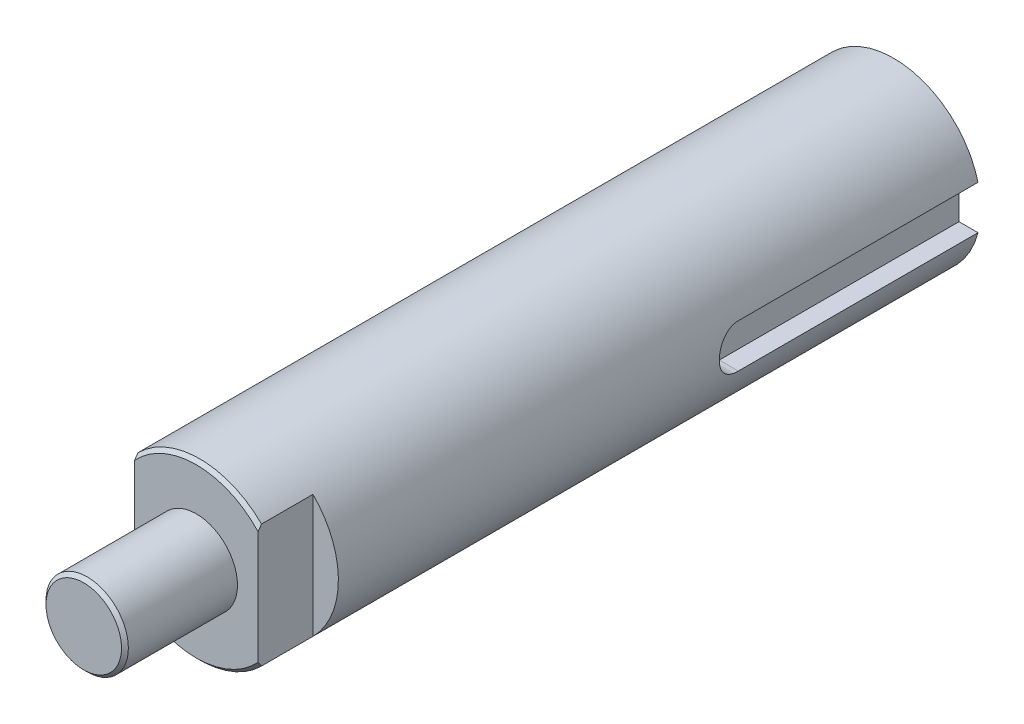
ISO-10303-21;
HEADER;
FILE_DESCRIPTION(('STEP AP214'),'2;1');
FILE_NAME('part.step','',(''),(''),'','','');
FILE_SCHEMA(('AUTOMOTIVE_DESIGN { 1 0 10303 214 1 1 1 1 }'));
ENDSEC;
DATA;
#1=APPLICATION_CONTEXT('core data for automotive mechanical design processes');
#2=APPLICATION_PROTOCOL_DEFINITION('international standard','automotive_design',2000,#1);
#3=PRODUCT_CONTEXT('',#1,'mechanical');
#4=PRODUCT('Part','Part','',(#3));
#5=PRODUCT_RELATED_PRODUCT_CATEGORY('part','',(#4));
#6=PRODUCT_DEFINITION_FORMATION('','',#4);
#7=PRODUCT_DEFINITION_CONTEXT('part definition',#1,'design');
#8=PRODUCT_DEFINITION('design','',#6,#7);
#9=PRODUCT_DEFINITION_SHAPE('','',#8);
#10=(LENGTH_UNIT() NAMED_UNIT(*) SI_UNIT(.MILLI.,.METRE.));
#11=(NAMED_UNIT(*) PLANE_ANGLE_UNIT() SI_UNIT($,.RADIAN.));
#12=(NAMED_UNIT(*) SI_UNIT($,.STERADIAN.) SOLID_ANGLE_UNIT());
#13=UNCERTAINTY_MEASURE_WITH_UNIT(LENGTH_MEASURE(1.E-05),#10,'distance_accuracy_value','');
#14=(GEOMETRIC_REPRESENTATION_CONTEXT(3) GLOBAL_UNCERTAINTY_ASSIGNED_CONTEXT((#13)) GLOBAL_UNIT_ASSIGNED_CONTEXT((#10,
#11,#12)) REPRESENTATION_CONTEXT('',''));
#15=CARTESIAN_POINT('',(0.,0.,0.));
#16=DIRECTION('',(0.,0.,1.));
#17=DIRECTION('',(1.,0.,0.));
#18=AXIS2_PLACEMENT_3D('',#15,#16,#17);
#19=CARTESIAN_POINT('',(4.69320694689479,1.5875,34.845625));
#20=DIRECTION('',(0.,-1.,0.));
#21=DIRECTION('',(0.,0.,-1.));
#22=AXIS2_PLACEMENT_3D('',#19,#20,#21);
#23=PLANE('',#22);
#24=DIRECTION('',(0.,0.,-1.));
#25=VECTOR('',#24,1.);
#26=CARTESIAN_POINT('',(4.7625,1.5875,36.5125));
#27=LINE('',#26,#25);
#28=CARTESIAN_POINT('',(4.7625,1.5875,12.7));
#29=VERTEX_POINT('',#28);
#30=CARTESIAN_POINT('',(4.7625,1.5875,30.1625));
#31=VERTEX_POINT('',#30);
#32=EDGE_CURVE('E35',#29,#31,#27,.F.);
#33=ORIENTED_EDGE('',*,*,#32,.F.);
#34=DIRECTION('',(1.,0.,0.));
#35=VECTOR('',#34,1.);
#36=CARTESIAN_POINT('',(4.69320694689479,1.5875,12.7));
#37=LINE('',#36,#35);
#38=CARTESIAN_POINT('',(6.14836106210428,1.58749999999999,12.7));
#39=VERTEX_POINT('',#38);
#40=EDGE_CURVE('E102',#29,#39,#37,.T.);
#41=ORIENTED_EDGE('',*,*,#40,.T.);
#42=DIRECTION('',(0.,0.,-1.));
#43=VECTOR('',#42,1.);
#44=CARTESIAN_POINT('',(6.14836106210428,1.58749999999999,0.));
#45=LINE('',#44,#43);
#46=CARTESIAN_POINT('',(6.14836106210428,1.58749999999999,30.1625));
#47=VERTEX_POINT('',#46);
#48=EDGE_CURVE('E152',#47,#39,#45,.T.);
#49=ORIENTED_EDGE('',*,*,#48,.F.);
#50=DIRECTION('',(1.,0.,0.));
#51=VECTOR('',#50,1.);
#52=CARTESIAN_POINT('',(5.55625,1.5875,30.1625));
#53=LINE('',#52,#51);
#54=EDGE_CURVE('E233',#31,#47,#53,.T.);
#55=ORIENTED_EDGE('',*,*,#54,.F.);
#56=EDGE_LOOP('',(#33,#41,#49,#55));
#57=FACE_BOUND('',#56,.T.);
#58=ADVANCED_FACE('F31',(#57),#23,.T.);
#59=CARTESIAN_POINT('',(4.7625,-1.74625,36.5125));
#60=DIRECTION('',(1.,0.,0.));
#61=DIRECTION('',(0.,0.,-1.));
#62=AXIS2_PLACEMENT_3D('',#59,#60,#61);
#63=PLANE('',#62);
#64=DIRECTION('',(0.,0.,1.));
#65=VECTOR('',#64,1.);
#66=CARTESIAN_POINT('',(4.7625,-1.5875,-68.183125));
#67=LINE('',#66,#65);
#68=CARTESIAN_POINT('',(4.7625,-1.5875,12.7));
#69=VERTEX_POINT('',#68);
#70=CARTESIAN_POINT('',(4.7625,-1.5875,30.1625));
#71=VERTEX_POINT('',#70);
#72=EDGE_CURVE('E209',#69,#71,#67,.T.);
#73=ORIENTED_EDGE('',*,*,#72,.F.);
#74=DIRECTION('',(0.,1.,0.));
#75=VECTOR('',#74,1.);
#76=CARTESIAN_POINT('',(4.7625,-1.74625,12.7));
#77=LINE('',#76,#75);
#78=EDGE_CURVE('E48',#69,#29,#77,.T.);
#79=ORIENTED_EDGE('',*,*,#78,.T.);
#80=ORIENTED_EDGE('',*,*,#32,.T.);
#81=CARTESIAN_POINT('',(4.7625,0.,30.1625));
#82=DIRECTION('',(-1.,0.,0.));
#83=DIRECTION('',(0.,-1.,0.));
#84=AXIS2_PLACEMENT_3D('',#81,#82,#83);
#85=CIRCLE('',#84,1.5875);
#86=EDGE_CURVE('E153',#31,#71,#85,.F.);
#87=ORIENTED_EDGE('',*,*,#86,.T.);
#88=EDGE_LOOP('',(#73,#79,#80,#87));
#89=FACE_BOUND('',#88,.T.);
#90=ADVANCED_FACE('F198',(#89),#63,.T.);
#91=CARTESIAN_POINT('',(0.,0.,63.25));
#92=DIRECTION('',(0.,0.,1.));
#93=DIRECTION('',(1.,0.,0.));
#94=AXIS2_PLACEMENT_3D('',#91,#92,#93);
#95=CYLINDRICAL_SURFACE('',#94,6.35);
#96=CARTESIAN_POINT('',(0.,0.,59.5));
#97=DIRECTION('',(0.,0.,1.));
#98=DIRECTION('',(1.,0.,0.));
#99=AXIS2_PLACEMENT_3D('',#96,#97,#98);
#100=CIRCLE('',#99,6.35);
#101=CARTESIAN_POINT('',(4.5,4.48023436886956,59.5));
#102=VERTEX_POINT('',#101);
#103=CARTESIAN_POINT('',(4.5,-4.48023436886955,59.5));
#104=VERTEX_POINT('',#103);
#105=EDGE_CURVE('E145',#102,#104,#100,.F.);
#106=ORIENTED_EDGE('',*,*,#105,.T.);
#107=DIRECTION('',(0.,0.,1.));
#108=VECTOR('',#107,1.);
#109=CARTESIAN_POINT('',(4.5,-4.48023436886955,0.));
#110=LINE('',#109,#108);
#111=CARTESIAN_POINT('',(4.5,-4.48023436886956,63.25));
#112=VERTEX_POINT('',#111);
#113=EDGE_CURVE('E213',#104,#112,#110,.T.);
#114=ORIENTED_EDGE('',*,*,#113,.T.);
#115=CARTESIAN_POINT('',(0.,0.,63.25));
#116=DIRECTION('',(0.,0.,1.));
#117=DIRECTION('',(-1.,0.,0.));
#118=AXIS2_PLACEMENT_3D('',#115,#116,#117);
#119=CIRCLE('',#118,6.35);
#120=CARTESIAN_POINT('',(-4.5,-4.48023436886956,63.25));
#121=VERTEX_POINT('',#120);
#122=EDGE_CURVE('E141',#112,#121,#119,.F.);
#123=ORIENTED_EDGE('',*,*,#122,.T.);
#124=DIRECTION('',(0.,0.,-1.));
#125=VECTOR('',#124,1.);
#126=CARTESIAN_POINT('',(-4.5,-4.48023436886956,0.));
#127=LINE('',#126,#125);
#128=CARTESIAN_POINT('',(-4.5,-4.48023436886956,59.5));
#129=VERTEX_POINT('',#128);
#130=EDGE_CURVE('E139',#121,#129,#127,.T.);
#131=ORIENTED_EDGE('',*,*,#130,.T.);
#132=CARTESIAN_POINT('',(0.,0.,59.5));
#133=DIRECTION('',(0.,0.,1.));
#134=DIRECTION('',(1.,0.,0.));
#135=AXIS2_PLACEMENT_3D('',#132,#133,#134);
#136=CIRCLE('',#135,6.35);
#137=CARTESIAN_POINT('',(-4.5,4.48023436886956,59.5));
#138=VERTEX_POINT('',#137);
#139=EDGE_CURVE('E119',#129,#138,#136,.F.);
#140=ORIENTED_EDGE('',*,*,#139,.T.);
#141=DIRECTION('',(0.,0.,1.));
#142=VECTOR('',#141,1.);
#143=CARTESIAN_POINT('',(-4.5,4.48023436886956,0.));
#144=LINE('',#143,#142);
#145=CARTESIAN_POINT('',(-4.5,4.48023436886956,63.25));
#146=VERTEX_POINT('',#145);
#147=EDGE_CURVE('E127',#138,#146,#144,.T.);
#148=ORIENTED_EDGE('',*,*,#147,.T.);
#149=CARTESIAN_POINT('',(0.,0.,63.25));
#150=DIRECTION('',(0.,0.,1.));
#151=DIRECTION('',(-1.,0.,0.));
#152=AXIS2_PLACEMENT_3D('',#149,#150,#151);
#153=CIRCLE('',#152,6.35);
#154=CARTESIAN_POINT('',(4.5,4.48023436886956,63.25));
#155=VERTEX_POINT('',#154);
#156=EDGE_CURVE('E133',#146,#155,#153,.F.);
#157=ORIENTED_EDGE('',*,*,#156,.T.);
#158=DIRECTION('',(0.,0.,-1.));
#159=VECTOR('',#158,1.);
#160=CARTESIAN_POINT('',(4.5,4.48023436886956,0.));
#161=LINE('',#160,#159);
#162=EDGE_CURVE('E229',#155,#102,#161,.T.);
#163=ORIENTED_EDGE('',*,*,#162,.T.);
#164=EDGE_LOOP('',(#106,#114,#123,#131,#140,#148,#157,#163));
#165=FACE_BOUND('',#164,.T.);
#166=ORIENTED_EDGE('',*,*,#48,.T.);
#167=CARTESIAN_POINT('',(0.,0.,12.7));
#168=DIRECTION('',(0.,0.,-1.));
#169=DIRECTION('',(-1.,0.,0.));
#170=AXIS2_PLACEMENT_3D('',#167,#168,#169);
#171=CIRCLE('',#170,6.35);
#172=CARTESIAN_POINT('',(6.14836106210428,-1.5875,12.7));
#173=VERTEX_POINT('',#172);
#174=EDGE_CURVE('E390',#39,#173,#171,.F.);
#175=ORIENTED_EDGE('',*,*,#174,.T.);
#176=DIRECTION('',(0.,0.,1.));
#177=VECTOR('',#176,1.);
#178=CARTESIAN_POINT('',(6.14836106210428,-1.5875,-68.183125));
#179=LINE('',#178,#177);
#180=CARTESIAN_POINT('',(6.14836106210428,-1.5875,30.1625));
#181=VERTEX_POINT('',#180);
#182=EDGE_CURVE('E41',#181,#173,#179,.F.);
#183=ORIENTED_EDGE('',*,*,#182,.F.);
#184=CARTESIAN_POINT('',(6.14836106210427,-1.5875,30.1625));
#185=CARTESIAN_POINT('',(6.14835810868573,-1.58750053472211,30.2064149519943));
#186=CARTESIAN_POINT('',(6.1488321571389,-1.58567661174546,30.2503081438792));
#187=CARTESIAN_POINT('',(6.15070373440419,-1.57840569717736,30.3377662599224));
#188=CARTESIAN_POINT('',(6.15210110782842,-1.57295931521449,30.3813312380687));
#189=CARTESIAN_POINT('',(6.1576221525004,-1.55126572658893,30.5108817698074));
#190=CARTESIAN_POINT('',(6.16307509376748,-1.52966372960041,30.595977074072));
#191=CARTESIAN_POINT('',(6.17688995608206,-1.47287895457943,30.7611868798194));
#192=CARTESIAN_POINT('',(6.18525165274125,-1.43769722409702,30.8413017649419));
#193=CARTESIAN_POINT('',(6.20393662510198,-1.35479517756304,30.9945295247074));
#194=CARTESIAN_POINT('',(6.21426035741522,-1.30707194181757,31.0676407634689));
#195=CARTESIAN_POINT('',(6.23595707887749,-1.1993371670561,31.2063439347201));
#196=CARTESIAN_POINT('',(6.24734667388769,-1.13910300733152,31.271760299379));
#197=CARTESIAN_POINT('',(6.26975132963679,-1.00851371119877,31.3916937691142));
#198=CARTESIAN_POINT('',(6.28076625476574,-0.938154957437522,31.4462069619563));
#199=CARTESIAN_POINT('',(6.30136714833112,-0.788089535804105,31.5435081462468));
#200=CARTESIAN_POINT('',(6.31093033514495,-0.708263180753407,31.5861165956048));
#201=CARTESIAN_POINT('',(6.32734283789911,-0.542357177260235,31.6572003435318));
#202=CARTESIAN_POINT('',(6.33419540463604,-0.456285166695508,31.685692581835));
#203=CARTESIAN_POINT('',(6.34280690605921,-0.308152380307642,31.7210378606793));
#204=CARTESIAN_POINT('',(6.34549035539136,-0.247067257357061,31.7318799469506));
#205=CARTESIAN_POINT('',(6.3490876888745,-0.123996454410234,31.7463623085414));
#206=CARTESIAN_POINT('',(6.35000159882553,-0.062010787557275,31.7500026888624));
#207=CARTESIAN_POINT('',(6.34999773933436,0.0876803967486356,31.7499961980724));
#208=CARTESIAN_POINT('',(6.34816513335973,0.175411016460152,31.742708932828));
#209=CARTESIAN_POINT('',(6.34102879138945,0.348380525034637,31.7137871064531));
#210=CARTESIAN_POINT('',(6.33572174751383,0.433616958406108,31.6921388725301));
#211=CARTESIAN_POINT('',(6.32222512421158,0.599040292949523,31.6352341920645));
#212=CARTESIAN_POINT('',(6.3140394800964,0.679233912557767,31.5999963174863));
#213=CARTESIAN_POINT('',(6.29565763049597,0.832565934999531,31.5169718450794));
#214=CARTESIAN_POINT('',(6.28546147615122,0.905704517218627,31.4691855664289));
#215=CARTESIAN_POINT('',(6.26393038121457,1.04436365780342,31.3613805762075));
#216=CARTESIAN_POINT('',(6.25257786624043,1.10971829889362,31.3011519679792));
#217=CARTESIAN_POINT('',(6.2301296384948,1.22951519838159,31.1706157524361));
#218=CARTESIAN_POINT('',(6.21903396685861,1.28395571935549,31.1003065434363));
#219=CARTESIAN_POINT('',(6.19817668389332,1.38116725538388,30.9503082320332));
#220=CARTESIAN_POINT('',(6.18843780250452,1.42374920363026,30.8704932823966));
#221=CARTESIAN_POINT('',(6.17166094046039,1.49480507045921,30.7045731029571));
#222=CARTESIAN_POINT('',(6.16462093284005,1.52328958149317,30.6184726519095));
#223=CARTESIAN_POINT('',(6.15576956135878,1.55859647860432,30.4703419677354));
#224=CARTESIAN_POINT('',(6.15300921691422,1.5694184144922,30.4092921880725));
#225=CARTESIAN_POINT('',(6.14929718216966,1.58387467718142,30.2863392534877));
#226=CARTESIAN_POINT('',(6.14834418929123,1.58751418051883,30.2244367455719));
#227=CARTESIAN_POINT('',(6.14836106210427,1.5875,30.1625));
#228=B_SPLINE_CURVE_WITH_KNOTS('',3,(#184,#185,#186,#187,#188,#189,#190,#191,#192,#193,#194,
#195,#196,#197,#198,#199,#200,#201,#202,#203,#204,#205,#206,#207,#208,#209,#210,#211,#212,#213,
#214,#215,#216,#217,#218,#219,#220,#221,#222,#223,#224,#225,#226,#227),.UNSPECIFIED.,.F.,.F.,(4,
2,2,2,2,2,2,2,2,2,2,2,2,2,2,2,2,2,2,2,2,4),(0.,0.131661631551339,0.263301111190632,
0.525827565802086,0.788333772987202,1.05090114649685,1.31861744482507,1.58642963242961,
1.85808613315677,2.12941584627081,2.31528840630699,2.50115825628429,2.76396966106714,
3.02703164315823,3.28973538447958,3.5524324443777,3.81998818241836,4.08758647901982,
4.35923443864542,4.63067797793237,4.81644389573702,5.00207587901888),.UNSPECIFIED.);
#229=EDGE_CURVE('E56',#181,#47,#228,.T.);
#230=ORIENTED_EDGE('',*,*,#229,.T.);
#231=EDGE_LOOP('',(#166,#175,#183,#230));
#232=FACE_BOUND('',#231,.T.);
#233=ADVANCED_FACE('F136',(#165,#232),#95,.T.);
#234=CARTESIAN_POINT('',(4.69320694689479,-1.5875,-68.183125));
#235=DIRECTION('',(0.,1.,0.));
#236=DIRECTION('',(0.,0.,1.));
#237=AXIS2_PLACEMENT_3D('',#234,#235,#236);
#238=PLANE('',#237);
#239=ORIENTED_EDGE('',*,*,#182,.T.);
#240=DIRECTION('',(-1.,0.,0.));
#241=VECTOR('',#240,1.);
#242=CARTESIAN_POINT('',(4.69320694689478,-1.5875,12.7));
#243=LINE('',#242,#241);
#244=EDGE_CURVE('E12',#173,#69,#243,.T.);
#245=ORIENTED_EDGE('',*,*,#244,.T.);
#246=ORIENTED_EDGE('',*,*,#72,.T.);
#247=DIRECTION('',(-1.,0.,0.));
#248=VECTOR('',#247,1.);
#249=CARTESIAN_POINT('',(5.55625,-1.5875,30.1625));
#250=LINE('',#249,#248);
#251=EDGE_CURVE('E235',#181,#71,#250,.T.);
#252=ORIENTED_EDGE('',*,*,#251,.F.);
#253=EDGE_LOOP('',(#239,#245,#246,#252));
#254=FACE_BOUND('',#253,.T.);
#255=ADVANCED_FACE('F33',(#254),#238,.T.);
#256=CARTESIAN_POINT('',(-3.025,-3.025,71.7));
#257=DIRECTION('',(0.,0.,1.));
#258=DIRECTION('',(1.,0.,0.));
#259=AXIS2_PLACEMENT_3D('',#256,#257,#258);
#260=PLANE('',#259);
#261=CARTESIAN_POINT('',(0.,0.,71.7));
#262=DIRECTION('',(0.,0.,-1.));
#263=DIRECTION('',(-1.,0.,0.));
#264=AXIS2_PLACEMENT_3D('',#261,#262,#263);
#265=CIRCLE('',#264,2.75000000000001);
#266=CARTESIAN_POINT('',(-2.75000000000001,0.,71.7));
#267=VERTEX_POINT('',#266);
#268=EDGE_CURVE('E221',#267,#267,#265,.T.);
#269=ORIENTED_EDGE('',*,*,#268,.F.);
#270=EDGE_LOOP('',(#269));
#271=FACE_BOUND('',#270,.T.);
#272=ADVANCED_FACE('F294',(#271),#260,.T.);
#273=CARTESIAN_POINT('',(0.,0.,71.45));
#274=DIRECTION('',(0.,0.,-1.));
#275=DIRECTION('',(-1.,0.,0.));
#276=AXIS2_PLACEMENT_3D('',#273,#274,#275);
#277=CONICAL_SURFACE('',#276,3.,0.785398163397439);
#278=CARTESIAN_POINT('',(0.,0.,71.45));
#279=DIRECTION('',(0.,0.,1.));
#280=DIRECTION('',(-1.,0.,0.));
#281=AXIS2_PLACEMENT_3D('',#278,#279,#280);
#282=CIRCLE('',#281,3.);
#283=CARTESIAN_POINT('',(-3.,0.,71.45));
#284=VERTEX_POINT('',#283);
#285=EDGE_CURVE('E374',#284,#284,#282,.F.);
#286=ORIENTED_EDGE('',*,*,#285,.F.);
#287=EDGE_LOOP('',(#286));
#288=FACE_BOUND('',#287,.T.);
#289=ORIENTED_EDGE('',*,*,#268,.T.);
#290=EDGE_LOOP('',(#289));
#291=FACE_BOUND('',#290,.T.);
#292=ADVANCED_FACE('F285',(#288,#291),#277,.T.);
#293=CARTESIAN_POINT('',(0.,0.,71.45));
#294=DIRECTION('',(0.,0.,1.));
#295=DIRECTION('',(1.,0.,0.));
#296=AXIS2_PLACEMENT_3D('',#293,#294,#295);
#297=CYLINDRICAL_SURFACE('',#296,3.);
#298=ORIENTED_EDGE('',*,*,#285,.T.);
#299=EDGE_LOOP('',(#298));
#300=FACE_BOUND('',#299,.T.);
#301=CARTESIAN_POINT('',(0.,0.,63.5));
#302=DIRECTION('',(0.,0.,1.));
#303=DIRECTION('',(1.,0.,0.));
#304=AXIS2_PLACEMENT_3D('',#301,#302,#303);
#305=CIRCLE('',#304,3.);
#306=CARTESIAN_POINT('',(3.,0.,63.5));
#307=VERTEX_POINT('',#306);
#308=EDGE_CURVE('E238',#307,#307,#305,.F.);
#309=ORIENTED_EDGE('',*,*,#308,.F.);
#310=EDGE_LOOP('',(#309));
#311=FACE_BOUND('',#310,.T.);
#312=ADVANCED_FACE('F276',(#300,#311),#297,.T.);
#313=CARTESIAN_POINT('',(-4.95,-6.71,63.5));
#314=DIRECTION('',(0.,0.,1.));
#315=DIRECTION('',(1.,0.,0.));
#316=AXIS2_PLACEMENT_3D('',#313,#314,#315);
#317=PLANE('',#316);
#318=ORIENTED_EDGE('',*,*,#308,.T.);
#319=EDGE_LOOP('',(#318));
#320=FACE_BOUND('',#319,.T.);
#321=CARTESIAN_POINT('',(0.,0.,63.5));
#322=DIRECTION('',(0.,0.,-1.));
#323=DIRECTION('',(-1.,0.,0.));
#324=AXIS2_PLACEMENT_3D('',#321,#322,#323);
#325=CIRCLE('',#324,6.10000000000001);
#326=CARTESIAN_POINT('',(-4.5,4.11825205639481,63.5));
#327=VERTEX_POINT('',#326);
#328=CARTESIAN_POINT('',(4.5,4.11825205639481,63.5));
#329=VERTEX_POINT('',#328);
#330=EDGE_CURVE('E185',#327,#329,#325,.T.);
#331=ORIENTED_EDGE('',*,*,#330,.F.);
#332=DIRECTION('',(0.,1.,0.));
#333=VECTOR('',#332,1.);
#334=CARTESIAN_POINT('',(-4.5,-4.92825780575651,63.5));
#335=LINE('',#334,#333);
#336=CARTESIAN_POINT('',(-4.5,-4.11825205639481,63.5));
#337=VERTEX_POINT('',#336);
#338=EDGE_CURVE('E124',#337,#327,#335,.T.);
#339=ORIENTED_EDGE('',*,*,#338,.F.);
#340=CARTESIAN_POINT('',(0.,0.,63.5));
#341=DIRECTION('',(0.,0.,-1.));
#342=DIRECTION('',(-1.,0.,0.));
#343=AXIS2_PLACEMENT_3D('',#340,#341,#342);
#344=CIRCLE('',#343,6.1);
#345=CARTESIAN_POINT('',(4.5,-4.1182520563948,63.5));
#346=VERTEX_POINT('',#345);
#347=EDGE_CURVE('E96',#346,#337,#344,.T.);
#348=ORIENTED_EDGE('',*,*,#347,.F.);
#349=DIRECTION('',(0.,1.,0.));
#350=VECTOR('',#349,1.);
#351=CARTESIAN_POINT('',(4.5,-4.92825780575651,63.5));
#352=LINE('',#351,#350);
#353=EDGE_CURVE('E384',#329,#346,#352,.F.);
#354=ORIENTED_EDGE('',*,*,#353,.F.);
#355=EDGE_LOOP('',(#331,#339,#348,#354));
#356=FACE_BOUND('',#355,.T.);
#357=ADVANCED_FACE('F163',(#320,#356),#317,.T.);
#358=CARTESIAN_POINT('',(6.359525,0.,30.1625));
#359=DIRECTION('',(-1.,0.,0.));
#360=DIRECTION('',(0.,-1.,0.));
#361=AXIS2_PLACEMENT_3D('',#358,#359,#360);
#362=CYLINDRICAL_SURFACE('',#361,1.5875);
#363=ORIENTED_EDGE('',*,*,#86,.F.);
#364=ORIENTED_EDGE('',*,*,#54,.T.);
#365=ORIENTED_EDGE('',*,*,#229,.F.);
#366=ORIENTED_EDGE('',*,*,#251,.T.);
#367=EDGE_LOOP('',(#363,#364,#365,#366));
#368=FACE_BOUND('',#367,.T.);
#369=ADVANCED_FACE('F157',(#368),#362,.F.);
#370=CARTESIAN_POINT('',(0.,0.,63.25));
#371=DIRECTION('',(0.,0.,-1.));
#372=DIRECTION('',(-1.,0.,0.));
#373=AXIS2_PLACEMENT_3D('',#370,#371,#372);
#374=CONICAL_SURFACE('',#373,6.35000000000001,0.785398163397452);
#375=CARTESIAN_POINT('',(4.5,-4.11825205639481,63.5));
#376=CARTESIAN_POINT('',(4.5,-4.17901147246281,63.458954470691));
#377=CARTESIAN_POINT('',(4.5,-4.23955638914491,63.4175983614489));
#378=CARTESIAN_POINT('',(4.5,-4.36021715951315,63.3342650274543));
#379=CARTESIAN_POINT('',(4.5,-4.42033301365597,63.2922878033631));
#380=CARTESIAN_POINT('',(4.5,-4.48023436886957,63.25));
#381=B_SPLINE_CURVE_WITH_KNOTS('',3,(#375,#376,#377,#378,#379,#380),.UNSPECIFIED.,.F.,.F.,(4,2,
4),(0.,0.219963934246499,0.439927634332499),.UNSPECIFIED.);
#382=EDGE_CURVE('E178',#346,#112,#381,.T.);
#383=ORIENTED_EDGE('',*,*,#382,.F.);
#384=ORIENTED_EDGE('',*,*,#347,.T.);
#385=CARTESIAN_POINT('',(-4.5,-4.48023436886957,63.25));
#386=CARTESIAN_POINT('',(-4.5,-4.42033301365597,63.2922878033631));
#387=CARTESIAN_POINT('',(-4.5,-4.36021715951315,63.3342650274543));
#388=CARTESIAN_POINT('',(-4.5,-4.23955638914491,63.4175983614489));
#389=CARTESIAN_POINT('',(-4.5,-4.17901147246281,63.458954470691));
#390=CARTESIAN_POINT('',(-4.5,-4.11825205639481,63.5));
#391=B_SPLINE_CURVE_WITH_KNOTS('',3,(#385,#386,#387,#388,#389,#390),.UNSPECIFIED.,.F.,.F.,(4,2,
4),(0.,0.219963700085999,0.439927634332499),.UNSPECIFIED.);
#392=EDGE_CURVE('E171',#121,#337,#391,.T.);
#393=ORIENTED_EDGE('',*,*,#392,.F.);
#394=ORIENTED_EDGE('',*,*,#122,.F.);
#395=EDGE_LOOP('',(#383,#384,#393,#394));
#396=FACE_BOUND('',#395,.T.);
#397=ADVANCED_FACE('F162',(#396),#374,.T.);
#398=CARTESIAN_POINT('',(-6.41727006554476,-4.92825780575651,59.5));
#399=DIRECTION('',(0.,0.,1.));
#400=DIRECTION('',(1.,0.,0.));
#401=AXIS2_PLACEMENT_3D('',#398,#399,#400);
#402=PLANE('',#401);
#403=DIRECTION('',(0.,1.,0.));
#404=VECTOR('',#403,1.);
#405=CARTESIAN_POINT('',(-4.5,-4.92825780575651,59.5));
#406=LINE('',#405,#404);
#407=EDGE_CURVE('E115',#138,#129,#406,.F.);
#408=ORIENTED_EDGE('',*,*,#407,.F.);
#409=ORIENTED_EDGE('',*,*,#139,.F.);
#410=EDGE_LOOP('',(#408,#409));
#411=FACE_BOUND('',#410,.T.);
#412=ADVANCED_FACE('F117',(#411),#402,.T.);
#413=CARTESIAN_POINT('',(-4.5,-4.92825780575651,59.3));
#414=DIRECTION('',(-1.,0.,0.));
#415=DIRECTION('',(0.,0.,1.));
#416=AXIS2_PLACEMENT_3D('',#413,#414,#415);
#417=PLANE('',#416);
#418=ORIENTED_EDGE('',*,*,#407,.T.);
#419=ORIENTED_EDGE('',*,*,#130,.F.);
#420=ORIENTED_EDGE('',*,*,#392,.T.);
#421=ORIENTED_EDGE('',*,*,#338,.T.);
#422=CARTESIAN_POINT('',(-4.5,4.48023436886956,63.25));
#423=CARTESIAN_POINT('',(-4.50000009558924,4.4649613914344,63.2607757568189));
#424=CARTESIAN_POINT('',(-4.50000020265471,4.44967537760635,63.2715330408831));
#425=CARTESIAN_POINT('',(-4.50000041171611,4.41916190785276,63.292950117644));
#426=CARTESIAN_POINT('',(-4.50000051373692,4.40393459896384,63.3036101198317));
#427=CARTESIAN_POINT('',(-4.50000068587664,4.37353826941478,63.3248326359594));
#428=CARTESIAN_POINT('',(-4.50000075617019,4.35836939692252,63.3353953621055));
#429=CARTESIAN_POINT('',(-4.50000085082851,4.32808965804186,63.3564233218181));
#430=CARTESIAN_POINT('',(-4.50000087544764,4.31297894096484,63.3668887703828));
#431=CARTESIAN_POINT('',(-4.50000087404816,4.28281522195379,63.3877221726835));
#432=CARTESIAN_POINT('',(-4.50000084831224,4.26776237046447,63.3980903442334));
#433=CARTESIAN_POINT('',(-4.50000075170094,4.23771408140885,63.4187291891084));
#434=CARTESIAN_POINT('',(-4.50000068107956,4.22271879541591,63.4290000831038));
#435=CARTESIAN_POINT('',(-4.50000050902606,4.19278532694918,63.449444371767));
#436=CARTESIAN_POINT('',(-4.50000040776931,4.17784729716419,63.4596179899819));
#437=CARTESIAN_POINT('',(-4.50000020088182,4.14802801764441,63.4798677178098));
#438=CARTESIAN_POINT('',(-4.50000009527891,4.13314692171981,63.4899440539251));
#439=CARTESIAN_POINT('',(-4.5,4.11825205639481,63.5));
#440=B_SPLINE_CURVE_WITH_KNOTS('',3,(#422,#423,#424,#425,#426,#427,#428,#429,#430,#431,#432,
#433,#434,#435,#436,#437,#438,#439),.UNSPECIFIED.,.F.,.F.,(4,2,2,2,2,2,2,2,4),(0.,
0.056075180302654,0.111838545950335,0.167291105627148,0.222433900765225,0.277268006325227,
0.331794531589723,0.386014620969577,0.439929454823443),.UNSPECIFIED.);
#441=EDGE_CURVE('E123',#146,#327,#440,.T.);
#442=ORIENTED_EDGE('',*,*,#441,.F.);
#443=ORIENTED_EDGE('',*,*,#147,.F.);
#444=EDGE_LOOP('',(#418,#419,#420,#421,#442,#443));
#445=FACE_BOUND('',#444,.T.);
#446=ADVANCED_FACE('F128',(#445),#417,.T.);
#447=CARTESIAN_POINT('',(0.,0.,63.25));
#448=DIRECTION('',(0.,0.,-1.));
#449=DIRECTION('',(-1.,0.,0.));
#450=AXIS2_PLACEMENT_3D('',#447,#448,#449);
#451=CONICAL_SURFACE('',#450,6.35,0.785398163397447);
#452=ORIENTED_EDGE('',*,*,#441,.T.);
#453=ORIENTED_EDGE('',*,*,#330,.T.);
#454=CARTESIAN_POINT('',(4.5,4.48023436886957,63.25));
#455=CARTESIAN_POINT('',(4.5,4.42033301365596,63.2922878033631));
#456=CARTESIAN_POINT('',(4.5,4.36021715951315,63.3342650274543));
#457=CARTESIAN_POINT('',(4.5,4.23955638914491,63.4175983614489));
#458=CARTESIAN_POINT('',(4.5,4.17901147246281,63.458954470691));
#459=CARTESIAN_POINT('',(4.5,4.11825205639481,63.5));
#460=B_SPLINE_CURVE_WITH_KNOTS('',3,(#454,#455,#456,#457,#458,#459),.UNSPECIFIED.,.F.,.F.,(4,2,
4),(0.,0.219963700085998,0.439927634332496),.UNSPECIFIED.);
#461=EDGE_CURVE('E186',#155,#329,#460,.T.);
#462=ORIENTED_EDGE('',*,*,#461,.F.);
#463=ORIENTED_EDGE('',*,*,#156,.F.);
#464=EDGE_LOOP('',(#452,#453,#462,#463));
#465=FACE_BOUND('',#464,.T.);
#466=ADVANCED_FACE('F240',(#465),#451,.T.);
#467=CARTESIAN_POINT('',(4.40870142545025,-4.92825780575651,59.5));
#468=DIRECTION('',(0.,0.,1.));
#469=DIRECTION('',(1.,0.,0.));
#470=AXIS2_PLACEMENT_3D('',#467,#468,#469);
#471=PLANE('',#470);
#472=ORIENTED_EDGE('',*,*,#105,.F.);
#473=DIRECTION('',(0.,1.,0.));
#474=VECTOR('',#473,1.);
#475=CARTESIAN_POINT('',(4.5,-4.92825780575651,59.5));
#476=LINE('',#475,#474);
#477=EDGE_CURVE('E184',#104,#102,#476,.T.);
#478=ORIENTED_EDGE('',*,*,#477,.F.);
#479=EDGE_LOOP('',(#472,#478));
#480=FACE_BOUND('',#479,.T.);
#481=ADVANCED_FACE('F196',(#480),#471,.T.);
#482=CARTESIAN_POINT('',(4.5,-4.92825780575651,63.7));
#483=DIRECTION('',(1.,0.,0.));
#484=DIRECTION('',(0.,0.,-1.));
#485=AXIS2_PLACEMENT_3D('',#482,#483,#484);
#486=PLANE('',#485);
#487=ORIENTED_EDGE('',*,*,#461,.T.);
#488=ORIENTED_EDGE('',*,*,#353,.T.);
#489=ORIENTED_EDGE('',*,*,#382,.T.);
#490=ORIENTED_EDGE('',*,*,#113,.F.);
#491=ORIENTED_EDGE('',*,*,#477,.T.);
#492=ORIENTED_EDGE('',*,*,#162,.F.);
#493=EDGE_LOOP('',(#487,#488,#489,#490,#491,#492));
#494=FACE_BOUND('',#493,.T.);
#495=ADVANCED_FACE('F191',(#494),#486,.T.);
#496=CARTESIAN_POINT('',(26.65105133422,-41.5840439685797,12.7));
#497=DIRECTION('',(0.,0.,-1.));
#498=DIRECTION('',(-0.976880390877591,0.213786580305794,0.));
#499=AXIS2_PLACEMENT_3D('',#496,#497,#498);
#500=PLANE('',#499);
#501=ORIENTED_EDGE('',*,*,#78,.F.);
#502=ORIENTED_EDGE('',*,*,#244,.F.);
#503=ORIENTED_EDGE('',*,*,#174,.F.);
#504=ORIENTED_EDGE('',*,*,#40,.F.);
#505=EDGE_LOOP('',(#501,#502,#503,#504));
#506=FACE_BOUND('',#505,.T.);
#507=ADVANCED_FACE('F195',(#506),#500,.T.);
#508=CLOSED_SHELL('',(#58,#90,#233,#255,#272,#292,#312,#357,#369,#397,#412,#446,#466,#481,#495,#507));
#509=MANIFOLD_SOLID_BREP('B2',#508);
#510=ADVANCED_BREP_SHAPE_REPRESENTATION('',(#18,#509),#14);
#511=SHAPE_DEFINITION_REPRESENTATION(#9,#510);
ENDSEC;
END-ISO-10303-21;
